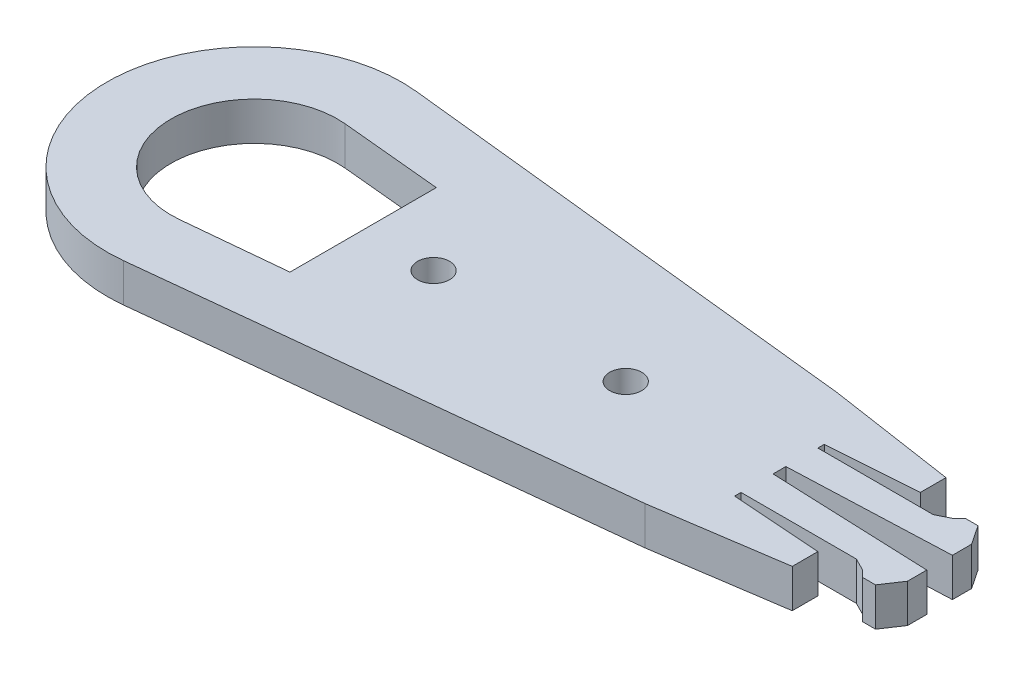
ISO-10303-21;
HEADER;
FILE_DESCRIPTION(('STEP AP214'),'2;1');
FILE_NAME('part.step','',(''),(''),'','','');
FILE_SCHEMA(('AUTOMOTIVE_DESIGN { 1 0 10303 214 1 1 1 1 }'));
ENDSEC;
DATA;
#1=APPLICATION_CONTEXT('core data for automotive mechanical design processes');
#2=APPLICATION_PROTOCOL_DEFINITION('international standard','automotive_design',2000,#1);
#3=PRODUCT_CONTEXT('',#1,'mechanical');
#4=PRODUCT('Part','Part','',(#3));
#5=PRODUCT_RELATED_PRODUCT_CATEGORY('part','',(#4));
#6=PRODUCT_DEFINITION_FORMATION('','',#4);
#7=PRODUCT_DEFINITION_CONTEXT('part definition',#1,'design');
#8=PRODUCT_DEFINITION('design','',#6,#7);
#9=PRODUCT_DEFINITION_SHAPE('','',#8);
#10=(LENGTH_UNIT() NAMED_UNIT(*) SI_UNIT(.MILLI.,.METRE.));
#11=(NAMED_UNIT(*) PLANE_ANGLE_UNIT() SI_UNIT($,.RADIAN.));
#12=(NAMED_UNIT(*) SI_UNIT($,.STERADIAN.) SOLID_ANGLE_UNIT());
#13=UNCERTAINTY_MEASURE_WITH_UNIT(LENGTH_MEASURE(1.E-05),#10,'distance_accuracy_value','');
#14=(GEOMETRIC_REPRESENTATION_CONTEXT(3) GLOBAL_UNCERTAINTY_ASSIGNED_CONTEXT((#13)) GLOBAL_UNIT_ASSIGNED_CONTEXT((#10,
#11,#12)) REPRESENTATION_CONTEXT('',''));
#15=CARTESIAN_POINT('',(0.,0.,0.));
#16=DIRECTION('',(0.,0.,1.));
#17=DIRECTION('',(1.,0.,0.));
#18=AXIS2_PLACEMENT_3D('',#15,#16,#17);
#19=CARTESIAN_POINT('',(1.93643031784841,-3.,12.9095354523227));
#20=DIRECTION('',(-0.148340452930245,0.,-0.988936352868297));
#21=DIRECTION('',(-0.988936352868298,0.,0.148340452930245));
#22=AXIS2_PLACEMENT_3D('',#19,#20,#21);
#23=PLANE('',#22);
#24=DIRECTION('',(-0.988936352868298,0.,0.148340452930245));
#25=VECTOR('',#24,1.);
#26=CARTESIAN_POINT('',(1.93643031784841,0.,12.9095354523227));
#27=LINE('',#26,#25);
#28=CARTESIAN_POINT('',(48.,0.,6.));
#29=VERTEX_POINT('',#28);
#30=CARTESIAN_POINT('',(38.,0.,7.5));
#31=VERTEX_POINT('',#30);
#32=EDGE_CURVE('E280',#29,#31,#27,.T.);
#33=ORIENTED_EDGE('',*,*,#32,.T.);
#34=DIRECTION('',(0.,1.,0.));
#35=VECTOR('',#34,1.);
#36=CARTESIAN_POINT('',(38.,-3.,7.5));
#37=LINE('',#36,#35);
#38=CARTESIAN_POINT('',(38.,-3.,7.5));
#39=VERTEX_POINT('',#38);
#40=EDGE_CURVE('E11',#39,#31,#37,.T.);
#41=ORIENTED_EDGE('',*,*,#40,.F.);
#42=DIRECTION('',(-0.988936352868298,0.,0.148340452930245));
#43=VECTOR('',#42,1.);
#44=CARTESIAN_POINT('',(1.93643031784841,-3.,12.9095354523227));
#45=LINE('',#44,#43);
#46=CARTESIAN_POINT('',(48.,-3.,6.));
#47=VERTEX_POINT('',#46);
#48=EDGE_CURVE('E423',#47,#39,#45,.T.);
#49=ORIENTED_EDGE('',*,*,#48,.F.);
#50=DIRECTION('',(0.,1.,0.));
#51=VECTOR('',#50,1.);
#52=CARTESIAN_POINT('',(48.,-3.,6.));
#53=LINE('',#52,#51);
#54=EDGE_CURVE('E397',#47,#29,#53,.T.);
#55=ORIENTED_EDGE('',*,*,#54,.T.);
#56=EDGE_LOOP('',(#33,#41,#49,#55));
#57=FACE_BOUND('',#56,.T.);
#58=ADVANCED_FACE('F34',(#57),#23,.F.);
#59=CARTESIAN_POINT('',(1.22340660120884,-3.,11.4347398872086));
#60=DIRECTION('',(-0.106383182713812,0.,-0.994325207583354));
#61=DIRECTION('',(-0.994325207583354,0.,0.106383182713812));
#62=AXIS2_PLACEMENT_3D('',#59,#60,#61);
#63=PLANE('',#62);
#64=DIRECTION('',(-0.994325207583354,0.,0.106383182713812));
#65=VECTOR('',#64,1.);
#66=CARTESIAN_POINT('',(1.22340660120884,0.,11.4347398872086));
#67=LINE('',#66,#65);
#68=CARTESIAN_POINT('',(1.22340660120884,0.,11.4347398872086));
#69=VERTEX_POINT('',#68);
#70=EDGE_CURVE('E152',#31,#69,#67,.T.);
#71=ORIENTED_EDGE('',*,*,#70,.T.);
#72=DIRECTION('',(0.,1.,0.));
#73=VECTOR('',#72,1.);
#74=CARTESIAN_POINT('',(1.22340660120884,-3.,11.4347398872086));
#75=LINE('',#74,#73);
#76=CARTESIAN_POINT('',(1.22340660120884,-3.,11.4347398872086));
#77=VERTEX_POINT('',#76);
#78=EDGE_CURVE('E44',#77,#69,#75,.T.);
#79=ORIENTED_EDGE('',*,*,#78,.F.);
#80=DIRECTION('',(-0.994325207583354,0.,0.106383182713812));
#81=VECTOR('',#80,1.);
#82=CARTESIAN_POINT('',(1.22340660120884,-3.,11.4347398872086));
#83=LINE('',#82,#81);
#84=EDGE_CURVE('E52',#39,#77,#83,.T.);
#85=ORIENTED_EDGE('',*,*,#84,.F.);
#86=ORIENTED_EDGE('',*,*,#40,.T.);
#87=EDGE_LOOP('',(#71,#79,#85,#86));
#88=FACE_BOUND('',#87,.T.);
#89=ADVANCED_FACE('F582',(#88),#63,.F.);
#90=CARTESIAN_POINT('',(0.,-3.,0.));
#91=DIRECTION('',(0.,1.,0.));
#92=DIRECTION('',(0.,0.,1.));
#93=AXIS2_PLACEMENT_3D('',#90,#91,#92);
#94=CYLINDRICAL_SURFACE('',#93,11.5);
#95=CARTESIAN_POINT('',(0.,0.,0.));
#96=DIRECTION('',(0.,1.,0.));
#97=DIRECTION('',(0.,0.,1.));
#98=AXIS2_PLACEMENT_3D('',#95,#96,#97);
#99=CIRCLE('',#98,11.5);
#100=CARTESIAN_POINT('',(1.22340660120884,0.,-11.4347398872086));
#101=VERTEX_POINT('',#100);
#102=EDGE_CURVE('E244',#101,#69,#99,.T.);
#103=ORIENTED_EDGE('',*,*,#102,.F.);
#104=DIRECTION('',(0.,1.,0.));
#105=VECTOR('',#104,1.);
#106=CARTESIAN_POINT('',(1.22340660120884,-3.,-11.4347398872086));
#107=LINE('',#106,#105);
#108=CARTESIAN_POINT('',(1.22340660120884,-3.,-11.4347398872086));
#109=VERTEX_POINT('',#108);
#110=EDGE_CURVE('E239',#109,#101,#107,.T.);
#111=ORIENTED_EDGE('',*,*,#110,.F.);
#112=CARTESIAN_POINT('',(0.,-3.,0.));
#113=DIRECTION('',(0.,1.,0.));
#114=DIRECTION('',(0.,0.,1.));
#115=AXIS2_PLACEMENT_3D('',#112,#113,#114);
#116=CIRCLE('',#115,11.5);
#117=EDGE_CURVE('E243',#109,#77,#116,.T.);
#118=ORIENTED_EDGE('',*,*,#117,.T.);
#119=ORIENTED_EDGE('',*,*,#78,.T.);
#120=EDGE_LOOP('',(#103,#111,#118,#119));
#121=FACE_BOUND('',#120,.T.);
#122=ADVANCED_FACE('F241',(#121),#94,.T.);
#123=CARTESIAN_POINT('',(1.22340660120883,-3.,-11.4347398872086));
#124=DIRECTION('',(-0.106383182713812,0.,0.994325207583354));
#125=DIRECTION('',(0.994325207583354,0.,0.106383182713812));
#126=AXIS2_PLACEMENT_3D('',#123,#124,#125);
#127=PLANE('',#126);
#128=DIRECTION('',(0.994325207583354,0.,0.106383182713812));
#129=VECTOR('',#128,1.);
#130=CARTESIAN_POINT('',(1.22340660120883,0.,-11.4347398872086));
#131=LINE('',#130,#129);
#132=CARTESIAN_POINT('',(38.,0.,-7.5));
#133=VERTEX_POINT('',#132);
#134=EDGE_CURVE('E338',#101,#133,#131,.T.);
#135=ORIENTED_EDGE('',*,*,#134,.T.);
#136=DIRECTION('',(0.,1.,0.));
#137=VECTOR('',#136,1.);
#138=CARTESIAN_POINT('',(38.,-3.,-7.5));
#139=LINE('',#138,#137);
#140=CARTESIAN_POINT('',(38.,-3.,-7.5));
#141=VERTEX_POINT('',#140);
#142=EDGE_CURVE('E248',#141,#133,#139,.T.);
#143=ORIENTED_EDGE('',*,*,#142,.F.);
#144=DIRECTION('',(0.994325207583354,0.,0.106383182713812));
#145=VECTOR('',#144,1.);
#146=CARTESIAN_POINT('',(1.22340660120883,-3.,-11.4347398872086));
#147=LINE('',#146,#145);
#148=EDGE_CURVE('E251',#109,#141,#147,.T.);
#149=ORIENTED_EDGE('',*,*,#148,.F.);
#150=ORIENTED_EDGE('',*,*,#110,.T.);
#151=EDGE_LOOP('',(#135,#143,#149,#150));
#152=FACE_BOUND('',#151,.T.);
#153=ADVANCED_FACE('F252',(#152),#127,.F.);
#154=CARTESIAN_POINT('',(1.93643031784841,-3.,-12.9095354523227));
#155=DIRECTION('',(0.148340452930245,0.,-0.988936352868297));
#156=DIRECTION('',(-0.988936352868298,0.,-0.148340452930245));
#157=AXIS2_PLACEMENT_3D('',#154,#155,#156);
#158=PLANE('',#157);
#159=DIRECTION('',(-0.988936352868298,0.,-0.148340452930245));
#160=VECTOR('',#159,1.);
#161=CARTESIAN_POINT('',(1.93643031784841,0.,-12.9095354523227));
#162=LINE('',#161,#160);
#163=CARTESIAN_POINT('',(48.,0.,-6.));
#164=VERTEX_POINT('',#163);
#165=EDGE_CURVE('E335',#164,#133,#162,.T.);
#166=ORIENTED_EDGE('',*,*,#165,.F.);
#167=DIRECTION('',(0.,1.,0.));
#168=VECTOR('',#167,1.);
#169=CARTESIAN_POINT('',(48.,-3.,-6.));
#170=LINE('',#169,#168);
#171=CARTESIAN_POINT('',(48.,-3.,-6.));
#172=VERTEX_POINT('',#171);
#173=EDGE_CURVE('E345',#172,#164,#170,.T.);
#174=ORIENTED_EDGE('',*,*,#173,.F.);
#175=DIRECTION('',(-0.988936352868298,0.,-0.148340452930245));
#176=VECTOR('',#175,1.);
#177=CARTESIAN_POINT('',(1.93643031784841,-3.,-12.9095354523227));
#178=LINE('',#177,#176);
#179=EDGE_CURVE('E256',#172,#141,#178,.T.);
#180=ORIENTED_EDGE('',*,*,#179,.T.);
#181=ORIENTED_EDGE('',*,*,#142,.T.);
#182=EDGE_LOOP('',(#166,#174,#180,#181));
#183=FACE_BOUND('',#182,.T.);
#184=ADVANCED_FACE('F483',(#183),#158,.T.);
#185=CARTESIAN_POINT('',(48.,-3.,0.));
#186=DIRECTION('',(1.,0.,0.));
#187=DIRECTION('',(0.,0.,-1.));
#188=AXIS2_PLACEMENT_3D('',#185,#186,#187);
#189=PLANE('',#188);
#190=DIRECTION('',(0.,0.,-1.));
#191=VECTOR('',#190,1.);
#192=CARTESIAN_POINT('',(48.,0.,0.));
#193=LINE('',#192,#191);
#194=CARTESIAN_POINT('',(48.,0.,-4.));
#195=VERTEX_POINT('',#194);
#196=EDGE_CURVE('E332',#195,#164,#193,.T.);
#197=ORIENTED_EDGE('',*,*,#196,.F.);
#198=DIRECTION('',(0.,1.,0.));
#199=VECTOR('',#198,1.);
#200=CARTESIAN_POINT('',(48.,-3.,-4.));
#201=LINE('',#200,#199);
#202=CARTESIAN_POINT('',(48.,-3.,-4.));
#203=VERTEX_POINT('',#202);
#204=EDGE_CURVE('E347',#203,#195,#201,.T.);
#205=ORIENTED_EDGE('',*,*,#204,.F.);
#206=DIRECTION('',(0.,0.,-1.));
#207=VECTOR('',#206,1.);
#208=CARTESIAN_POINT('',(48.,-3.,0.));
#209=LINE('',#208,#207);
#210=EDGE_CURVE('E479',#203,#172,#209,.T.);
#211=ORIENTED_EDGE('',*,*,#210,.T.);
#212=ORIENTED_EDGE('',*,*,#173,.T.);
#213=EDGE_LOOP('',(#197,#205,#211,#212));
#214=FACE_BOUND('',#213,.T.);
#215=ADVANCED_FACE('F488',(#214),#189,.T.);
#216=CARTESIAN_POINT('',(-0.0406091370558374,-3.,-0.568527918781723));
#217=DIRECTION('',(0.0712470499879097,0.,0.997458699830735));
#218=DIRECTION('',(0.997458699830735,0.,-0.0712470499879097));
#219=AXIS2_PLACEMENT_3D('',#216,#217,#218);
#220=PLANE('',#219);
#221=DIRECTION('',(0.997458699830735,0.,-0.0712470499879097));
#222=VECTOR('',#221,1.);
#223=CARTESIAN_POINT('',(-0.0406091370558374,0.,-0.568527918781723));
#224=LINE('',#223,#222);
#225=CARTESIAN_POINT('',(41.,0.,-3.5));
#226=VERTEX_POINT('',#225);
#227=EDGE_CURVE('E329',#226,#195,#224,.T.);
#228=ORIENTED_EDGE('',*,*,#227,.F.);
#229=DIRECTION('',(0.,1.,0.));
#230=VECTOR('',#229,1.);
#231=CARTESIAN_POINT('',(41.,-3.,-3.5));
#232=LINE('',#231,#230);
#233=CARTESIAN_POINT('',(41.,-3.,-3.5));
#234=VERTEX_POINT('',#233);
#235=EDGE_CURVE('E349',#234,#226,#232,.T.);
#236=ORIENTED_EDGE('',*,*,#235,.F.);
#237=DIRECTION('',(0.997458699830735,0.,-0.0712470499879097));
#238=VECTOR('',#237,1.);
#239=CARTESIAN_POINT('',(-0.0406091370558374,-3.,-0.568527918781723));
#240=LINE('',#239,#238);
#241=EDGE_CURVE('E476',#234,#203,#240,.T.);
#242=ORIENTED_EDGE('',*,*,#241,.T.);
#243=ORIENTED_EDGE('',*,*,#204,.T.);
#244=EDGE_LOOP('',(#228,#236,#242,#243));
#245=FACE_BOUND('',#244,.T.);
#246=ADVANCED_FACE('F491',(#245),#220,.T.);
#247=CARTESIAN_POINT('',(41.,-3.,0.));
#248=DIRECTION('',(1.,0.,0.));
#249=DIRECTION('',(0.,0.,-1.));
#250=AXIS2_PLACEMENT_3D('',#247,#248,#249);
#251=PLANE('',#250);
#252=DIRECTION('',(0.,0.,-1.));
#253=VECTOR('',#252,1.);
#254=CARTESIAN_POINT('',(41.,0.,0.));
#255=LINE('',#254,#253);
#256=CARTESIAN_POINT('',(41.,0.,-3.));
#257=VERTEX_POINT('',#256);
#258=EDGE_CURVE('E326',#257,#226,#255,.T.);
#259=ORIENTED_EDGE('',*,*,#258,.F.);
#260=DIRECTION('',(0.,1.,0.));
#261=VECTOR('',#260,1.);
#262=CARTESIAN_POINT('',(41.,-3.,-3.));
#263=LINE('',#262,#261);
#264=CARTESIAN_POINT('',(41.,-3.,-3.));
#265=VERTEX_POINT('',#264);
#266=EDGE_CURVE('E351',#265,#257,#263,.T.);
#267=ORIENTED_EDGE('',*,*,#266,.F.);
#268=DIRECTION('',(0.,0.,-1.));
#269=VECTOR('',#268,1.);
#270=CARTESIAN_POINT('',(41.,-3.,0.));
#271=LINE('',#270,#269);
#272=EDGE_CURVE('E473',#265,#234,#271,.T.);
#273=ORIENTED_EDGE('',*,*,#272,.T.);
#274=ORIENTED_EDGE('',*,*,#235,.T.);
#275=EDGE_LOOP('',(#259,#267,#273,#274));
#276=FACE_BOUND('',#275,.T.);
#277=ADVANCED_FACE('F496',(#276),#251,.T.);
#278=CARTESIAN_POINT('',(0.,-3.,-2.99999999999999));
#279=DIRECTION('',(0.,0.,-1.));
#280=DIRECTION('',(-1.,0.,0.));
#281=AXIS2_PLACEMENT_3D('',#278,#279,#280);
#282=PLANE('',#281);
#283=DIRECTION('',(-1.,0.,0.));
#284=VECTOR('',#283,1.);
#285=CARTESIAN_POINT('',(0.,0.,-2.99999999999999));
#286=LINE('',#285,#284);
#287=CARTESIAN_POINT('',(50.,0.,-3.));
#288=VERTEX_POINT('',#287);
#289=EDGE_CURVE('E323',#288,#257,#286,.T.);
#290=ORIENTED_EDGE('',*,*,#289,.F.);
#291=DIRECTION('',(0.,1.,0.));
#292=VECTOR('',#291,1.);
#293=CARTESIAN_POINT('',(50.,-3.,-3.));
#294=LINE('',#293,#292);
#295=CARTESIAN_POINT('',(50.,-3.,-3.));
#296=VERTEX_POINT('',#295);
#297=EDGE_CURVE('E353',#296,#288,#294,.T.);
#298=ORIENTED_EDGE('',*,*,#297,.F.);
#299=DIRECTION('',(-1.,0.,0.));
#300=VECTOR('',#299,1.);
#301=CARTESIAN_POINT('',(0.,-3.,-2.99999999999999));
#302=LINE('',#301,#300);
#303=EDGE_CURVE('E470',#296,#265,#302,.T.);
#304=ORIENTED_EDGE('',*,*,#303,.T.);
#305=ORIENTED_EDGE('',*,*,#266,.T.);
#306=EDGE_LOOP('',(#290,#298,#304,#305));
#307=FACE_BOUND('',#306,.T.);
#308=ADVANCED_FACE('F499',(#307),#282,.T.);
#309=CARTESIAN_POINT('',(8.79999999999999,-3.,17.6));
#310=DIRECTION('',(-0.447213595499958,0.,-0.894427190999916));
#311=DIRECTION('',(-0.894427190999916,0.,0.447213595499958));
#312=AXIS2_PLACEMENT_3D('',#309,#310,#311);
#313=PLANE('',#312);
#314=DIRECTION('',(-0.894427190999916,0.,0.447213595499958));
#315=VECTOR('',#314,1.);
#316=CARTESIAN_POINT('',(8.79999999999999,0.,17.6));
#317=LINE('',#316,#315);
#318=CARTESIAN_POINT('',(51.,0.,-3.5));
#319=VERTEX_POINT('',#318);
#320=EDGE_CURVE('E320',#319,#288,#317,.T.);
#321=ORIENTED_EDGE('',*,*,#320,.F.);
#322=DIRECTION('',(0.,1.,0.));
#323=VECTOR('',#322,1.);
#324=CARTESIAN_POINT('',(51.,-3.,-3.5));
#325=LINE('',#324,#323);
#326=CARTESIAN_POINT('',(51.,-3.,-3.5));
#327=VERTEX_POINT('',#326);
#328=EDGE_CURVE('E355',#327,#319,#325,.T.);
#329=ORIENTED_EDGE('',*,*,#328,.F.);
#330=DIRECTION('',(-0.894427190999916,0.,0.447213595499958));
#331=VECTOR('',#330,1.);
#332=CARTESIAN_POINT('',(8.79999999999999,-3.,17.6));
#333=LINE('',#332,#331);
#334=EDGE_CURVE('E467',#327,#296,#333,.T.);
#335=ORIENTED_EDGE('',*,*,#334,.T.);
#336=ORIENTED_EDGE('',*,*,#297,.T.);
#337=EDGE_LOOP('',(#321,#329,#335,#336));
#338=FACE_BOUND('',#337,.T.);
#339=ADVANCED_FACE('F504',(#338),#313,.T.);
#340=CARTESIAN_POINT('',(23.75,-3.,23.75));
#341=DIRECTION('',(-0.707106781186547,0.,-0.707106781186548));
#342=DIRECTION('',(-0.707106781186548,0.,0.707106781186547));
#343=AXIS2_PLACEMENT_3D('',#340,#341,#342);
#344=PLANE('',#343);
#345=DIRECTION('',(-0.707106781186548,0.,0.707106781186547));
#346=VECTOR('',#345,1.);
#347=CARTESIAN_POINT('',(23.75,0.,23.75));
#348=LINE('',#347,#346);
#349=CARTESIAN_POINT('',(51.5,0.,-4.));
#350=VERTEX_POINT('',#349);
#351=EDGE_CURVE('E317',#350,#319,#348,.T.);
#352=ORIENTED_EDGE('',*,*,#351,.F.);
#353=DIRECTION('',(0.,1.,0.));
#354=VECTOR('',#353,1.);
#355=CARTESIAN_POINT('',(51.5,-3.,-4.));
#356=LINE('',#355,#354);
#357=CARTESIAN_POINT('',(51.5,-3.,-4.));
#358=VERTEX_POINT('',#357);
#359=EDGE_CURVE('E357',#358,#350,#356,.T.);
#360=ORIENTED_EDGE('',*,*,#359,.F.);
#361=DIRECTION('',(-0.707106781186548,0.,0.707106781186547));
#362=VECTOR('',#361,1.);
#363=CARTESIAN_POINT('',(23.75,-3.,23.75));
#364=LINE('',#363,#362);
#365=EDGE_CURVE('E464',#358,#327,#364,.T.);
#366=ORIENTED_EDGE('',*,*,#365,.T.);
#367=ORIENTED_EDGE('',*,*,#328,.T.);
#368=EDGE_LOOP('',(#352,#360,#366,#367));
#369=FACE_BOUND('',#368,.T.);
#370=ADVANCED_FACE('F507',(#369),#344,.T.);
#371=CARTESIAN_POINT('',(0.,-3.,-3.99999999999996));
#372=DIRECTION('',(0.,0.,-1.));
#373=DIRECTION('',(-1.,0.,0.));
#374=AXIS2_PLACEMENT_3D('',#371,#372,#373);
#375=PLANE('',#374);
#376=DIRECTION('',(-1.,0.,0.));
#377=VECTOR('',#376,1.);
#378=CARTESIAN_POINT('',(0.,0.,-3.99999999999996));
#379=LINE('',#378,#377);
#380=CARTESIAN_POINT('',(52.5,0.,-4.));
#381=VERTEX_POINT('',#380);
#382=EDGE_CURVE('E314',#381,#350,#379,.T.);
#383=ORIENTED_EDGE('',*,*,#382,.F.);
#384=DIRECTION('',(0.,1.,0.));
#385=VECTOR('',#384,1.);
#386=CARTESIAN_POINT('',(52.5,-3.,-4.));
#387=LINE('',#386,#385);
#388=CARTESIAN_POINT('',(52.5,-3.,-4.));
#389=VERTEX_POINT('',#388);
#390=EDGE_CURVE('E359',#389,#381,#387,.T.);
#391=ORIENTED_EDGE('',*,*,#390,.F.);
#392=DIRECTION('',(-1.,0.,0.));
#393=VECTOR('',#392,1.);
#394=CARTESIAN_POINT('',(0.,-3.,-3.99999999999996));
#395=LINE('',#394,#393);
#396=EDGE_CURVE('E461',#389,#358,#395,.T.);
#397=ORIENTED_EDGE('',*,*,#396,.T.);
#398=ORIENTED_EDGE('',*,*,#359,.T.);
#399=EDGE_LOOP('',(#383,#391,#397,#398));
#400=FACE_BOUND('',#399,.T.);
#401=ADVANCED_FACE('F512',(#400),#375,.T.);
#402=CARTESIAN_POINT('',(38.1923076923077,-3.,-25.4615384615385));
#403=DIRECTION('',(0.832050294337844,0.,-0.554700196225229));
#404=DIRECTION('',(-0.554700196225229,0.,-0.832050294337843));
#405=AXIS2_PLACEMENT_3D('',#402,#403,#404);
#406=PLANE('',#405);
#407=DIRECTION('',(-0.554700196225229,0.,-0.832050294337844));
#408=VECTOR('',#407,1.);
#409=CARTESIAN_POINT('',(38.1923076923077,0.,-25.4615384615385));
#410=LINE('',#409,#408);
#411=CARTESIAN_POINT('',(53.5,0.,-2.5));
#412=VERTEX_POINT('',#411);
#413=EDGE_CURVE('E311',#412,#381,#410,.T.);
#414=ORIENTED_EDGE('',*,*,#413,.F.);
#415=DIRECTION('',(0.,1.,0.));
#416=VECTOR('',#415,1.);
#417=CARTESIAN_POINT('',(53.5,-3.,-2.5));
#418=LINE('',#417,#416);
#419=CARTESIAN_POINT('',(53.5,-3.,-2.5));
#420=VERTEX_POINT('',#419);
#421=EDGE_CURVE('E361',#420,#412,#418,.T.);
#422=ORIENTED_EDGE('',*,*,#421,.F.);
#423=DIRECTION('',(-0.554700196225229,0.,-0.832050294337844));
#424=VECTOR('',#423,1.);
#425=CARTESIAN_POINT('',(38.1923076923077,-3.,-25.4615384615385));
#426=LINE('',#425,#424);
#427=EDGE_CURVE('E458',#420,#389,#426,.T.);
#428=ORIENTED_EDGE('',*,*,#427,.T.);
#429=ORIENTED_EDGE('',*,*,#390,.T.);
#430=EDGE_LOOP('',(#414,#422,#428,#429));
#431=FACE_BOUND('',#430,.T.);
#432=ADVANCED_FACE('F515',(#431),#406,.T.);
#433=CARTESIAN_POINT('',(53.5,-3.,0.));
#434=DIRECTION('',(1.,0.,0.));
#435=DIRECTION('',(0.,0.,-1.));
#436=AXIS2_PLACEMENT_3D('',#433,#434,#435);
#437=PLANE('',#436);
#438=DIRECTION('',(0.,0.,-1.));
#439=VECTOR('',#438,1.);
#440=CARTESIAN_POINT('',(53.5,0.,0.));
#441=LINE('',#440,#439);
#442=CARTESIAN_POINT('',(53.5,0.,-1.));
#443=VERTEX_POINT('',#442);
#444=EDGE_CURVE('E308',#443,#412,#441,.T.);
#445=ORIENTED_EDGE('',*,*,#444,.F.);
#446=DIRECTION('',(0.,1.,0.));
#447=VECTOR('',#446,1.);
#448=CARTESIAN_POINT('',(53.5,-3.,-1.));
#449=LINE('',#448,#447);
#450=CARTESIAN_POINT('',(53.5,-3.,-1.));
#451=VERTEX_POINT('',#450);
#452=EDGE_CURVE('E363',#451,#443,#449,.T.);
#453=ORIENTED_EDGE('',*,*,#452,.F.);
#454=DIRECTION('',(0.,0.,-1.));
#455=VECTOR('',#454,1.);
#456=CARTESIAN_POINT('',(53.5,-3.,0.));
#457=LINE('',#456,#455);
#458=EDGE_CURVE('E455',#451,#420,#457,.T.);
#459=ORIENTED_EDGE('',*,*,#458,.T.);
#460=ORIENTED_EDGE('',*,*,#421,.T.);
#461=EDGE_LOOP('',(#445,#453,#459,#460));
#462=FACE_BOUND('',#461,.T.);
#463=ADVANCED_FACE('F520',(#462),#437,.T.);
#464=CARTESIAN_POINT('',(0.0455271565495208,-3.,1.13817891373802));
#465=DIRECTION('',(0.0399680383488716,0.,0.999200958721789));
#466=DIRECTION('',(0.99920095872179,0.,-0.0399680383488716));
#467=AXIS2_PLACEMENT_3D('',#464,#465,#466);
#468=PLANE('',#467);
#469=DIRECTION('',(0.99920095872179,0.,-0.0399680383488716));
#470=VECTOR('',#469,1.);
#471=CARTESIAN_POINT('',(0.0455271565495208,0.,1.13817891373802));
#472=LINE('',#471,#470);
#473=CARTESIAN_POINT('',(41.,0.,-0.5));
#474=VERTEX_POINT('',#473);
#475=EDGE_CURVE('E305',#474,#443,#472,.T.);
#476=ORIENTED_EDGE('',*,*,#475,.F.);
#477=DIRECTION('',(0.,1.,0.));
#478=VECTOR('',#477,1.);
#479=CARTESIAN_POINT('',(41.,-3.,-0.5));
#480=LINE('',#479,#478);
#481=CARTESIAN_POINT('',(41.,-3.,-0.5));
#482=VERTEX_POINT('',#481);
#483=EDGE_CURVE('E365',#482,#474,#480,.T.);
#484=ORIENTED_EDGE('',*,*,#483,.F.);
#485=DIRECTION('',(0.99920095872179,0.,-0.0399680383488716));
#486=VECTOR('',#485,1.);
#487=CARTESIAN_POINT('',(0.0455271565495208,-3.,1.13817891373802));
#488=LINE('',#487,#486);
#489=EDGE_CURVE('E452',#482,#451,#488,.T.);
#490=ORIENTED_EDGE('',*,*,#489,.T.);
#491=ORIENTED_EDGE('',*,*,#452,.T.);
#492=EDGE_LOOP('',(#476,#484,#490,#491));
#493=FACE_BOUND('',#492,.T.);
#494=ADVANCED_FACE('F523',(#493),#468,.T.);
#495=CARTESIAN_POINT('',(41.,-3.,0.));
#496=DIRECTION('',(-1.,0.,0.));
#497=DIRECTION('',(0.,0.,1.));
#498=AXIS2_PLACEMENT_3D('',#495,#496,#497);
#499=PLANE('',#498);
#500=DIRECTION('',(0.,0.,1.));
#501=VECTOR('',#500,1.);
#502=CARTESIAN_POINT('',(41.,0.,0.));
#503=LINE('',#502,#501);
#504=CARTESIAN_POINT('',(41.,0.,0.5));
#505=VERTEX_POINT('',#504);
#506=EDGE_CURVE('E303',#474,#505,#503,.T.);
#507=ORIENTED_EDGE('',*,*,#506,.T.);
#508=DIRECTION('',(0.,1.,0.));
#509=VECTOR('',#508,1.);
#510=CARTESIAN_POINT('',(41.,-3.,0.5));
#511=LINE('',#510,#509);
#512=CARTESIAN_POINT('',(41.,-3.,0.5));
#513=VERTEX_POINT('',#512);
#514=EDGE_CURVE('E367',#513,#505,#511,.T.);
#515=ORIENTED_EDGE('',*,*,#514,.F.);
#516=DIRECTION('',(0.,0.,1.));
#517=VECTOR('',#516,1.);
#518=CARTESIAN_POINT('',(41.,-3.,0.));
#519=LINE('',#518,#517);
#520=EDGE_CURVE('E450',#482,#513,#519,.T.);
#521=ORIENTED_EDGE('',*,*,#520,.F.);
#522=ORIENTED_EDGE('',*,*,#483,.T.);
#523=EDGE_LOOP('',(#507,#515,#521,#522));
#524=FACE_BOUND('',#523,.T.);
#525=ADVANCED_FACE('F529',(#524),#499,.F.);
#526=CARTESIAN_POINT('',(0.0455271565495208,-3.,-1.13817891373802));
#527=DIRECTION('',(-0.0399680383488716,0.,0.999200958721789));
#528=DIRECTION('',(0.99920095872179,0.,0.0399680383488716));
#529=AXIS2_PLACEMENT_3D('',#526,#527,#528);
#530=PLANE('',#529);
#531=DIRECTION('',(0.99920095872179,0.,0.0399680383488716));
#532=VECTOR('',#531,1.);
#533=CARTESIAN_POINT('',(0.0455271565495208,0.,-1.13817891373802));
#534=LINE('',#533,#532);
#535=CARTESIAN_POINT('',(53.5,0.,1.));
#536=VERTEX_POINT('',#535);
#537=EDGE_CURVE('E301',#505,#536,#534,.T.);
#538=ORIENTED_EDGE('',*,*,#537,.T.);
#539=DIRECTION('',(0.,1.,0.));
#540=VECTOR('',#539,1.);
#541=CARTESIAN_POINT('',(53.5,-3.,1.));
#542=LINE('',#541,#540);
#543=CARTESIAN_POINT('',(53.5,-3.,1.));
#544=VERTEX_POINT('',#543);
#545=EDGE_CURVE('E370',#544,#536,#542,.T.);
#546=ORIENTED_EDGE('',*,*,#545,.F.);
#547=DIRECTION('',(0.99920095872179,0.,0.0399680383488716));
#548=VECTOR('',#547,1.);
#549=CARTESIAN_POINT('',(0.0455271565495208,-3.,-1.13817891373802));
#550=LINE('',#549,#548);
#551=EDGE_CURVE('E448',#513,#544,#550,.T.);
#552=ORIENTED_EDGE('',*,*,#551,.F.);
#553=ORIENTED_EDGE('',*,*,#514,.T.);
#554=EDGE_LOOP('',(#538,#546,#552,#553));
#555=FACE_BOUND('',#554,.T.);
#556=ADVANCED_FACE('F533',(#555),#530,.F.);
#557=CARTESIAN_POINT('',(53.5,-3.,0.));
#558=DIRECTION('',(-1.,0.,0.));
#559=DIRECTION('',(0.,0.,1.));
#560=AXIS2_PLACEMENT_3D('',#557,#558,#559);
#561=PLANE('',#560);
#562=DIRECTION('',(0.,0.,1.));
#563=VECTOR('',#562,1.);
#564=CARTESIAN_POINT('',(53.5,0.,0.));
#565=LINE('',#564,#563);
#566=CARTESIAN_POINT('',(53.5,0.,2.5));
#567=VERTEX_POINT('',#566);
#568=EDGE_CURVE('E299',#536,#567,#565,.T.);
#569=ORIENTED_EDGE('',*,*,#568,.T.);
#570=DIRECTION('',(0.,1.,0.));
#571=VECTOR('',#570,1.);
#572=CARTESIAN_POINT('',(53.5,-3.,2.5));
#573=LINE('',#572,#571);
#574=CARTESIAN_POINT('',(53.5,-3.,2.5));
#575=VERTEX_POINT('',#574);
#576=EDGE_CURVE('E373',#575,#567,#573,.T.);
#577=ORIENTED_EDGE('',*,*,#576,.F.);
#578=DIRECTION('',(0.,0.,1.));
#579=VECTOR('',#578,1.);
#580=CARTESIAN_POINT('',(53.5,-3.,0.));
#581=LINE('',#580,#579);
#582=EDGE_CURVE('E446',#544,#575,#581,.T.);
#583=ORIENTED_EDGE('',*,*,#582,.F.);
#584=ORIENTED_EDGE('',*,*,#545,.T.);
#585=EDGE_LOOP('',(#569,#577,#583,#584));
#586=FACE_BOUND('',#585,.T.);
#587=ADVANCED_FACE('F538',(#586),#561,.F.);
#588=CARTESIAN_POINT('',(38.1923076923077,-3.,25.4615384615385));
#589=DIRECTION('',(-0.832050294337844,0.,-0.554700196225229));
#590=DIRECTION('',(-0.554700196225229,0.,0.832050294337843));
#591=AXIS2_PLACEMENT_3D('',#588,#589,#590);
#592=PLANE('',#591);
#593=DIRECTION('',(-0.554700196225229,0.,0.832050294337844));
#594=VECTOR('',#593,1.);
#595=CARTESIAN_POINT('',(38.1923076923077,0.,25.4615384615385));
#596=LINE('',#595,#594);
#597=CARTESIAN_POINT('',(52.5,0.,4.));
#598=VERTEX_POINT('',#597);
#599=EDGE_CURVE('E297',#567,#598,#596,.T.);
#600=ORIENTED_EDGE('',*,*,#599,.T.);
#601=DIRECTION('',(0.,1.,0.));
#602=VECTOR('',#601,1.);
#603=CARTESIAN_POINT('',(52.5,-3.,4.));
#604=LINE('',#603,#602);
#605=CARTESIAN_POINT('',(52.5,-3.,4.));
#606=VERTEX_POINT('',#605);
#607=EDGE_CURVE('E376',#606,#598,#604,.T.);
#608=ORIENTED_EDGE('',*,*,#607,.F.);
#609=DIRECTION('',(-0.554700196225229,0.,0.832050294337844));
#610=VECTOR('',#609,1.);
#611=CARTESIAN_POINT('',(38.1923076923077,-3.,25.4615384615385));
#612=LINE('',#611,#610);
#613=EDGE_CURVE('E444',#575,#606,#612,.T.);
#614=ORIENTED_EDGE('',*,*,#613,.F.);
#615=ORIENTED_EDGE('',*,*,#576,.T.);
#616=EDGE_LOOP('',(#600,#608,#614,#615));
#617=FACE_BOUND('',#616,.T.);
#618=ADVANCED_FACE('F544',(#617),#592,.F.);
#619=CARTESIAN_POINT('',(0.,-3.,3.99999999999996));
#620=DIRECTION('',(0.,0.,-1.));
#621=DIRECTION('',(-1.,0.,0.));
#622=AXIS2_PLACEMENT_3D('',#619,#620,#621);
#623=PLANE('',#622);
#624=DIRECTION('',(-1.,0.,0.));
#625=VECTOR('',#624,1.);
#626=CARTESIAN_POINT('',(0.,0.,3.99999999999996));
#627=LINE('',#626,#625);
#628=CARTESIAN_POINT('',(51.5,0.,4.));
#629=VERTEX_POINT('',#628);
#630=EDGE_CURVE('E295',#598,#629,#627,.T.);
#631=ORIENTED_EDGE('',*,*,#630,.T.);
#632=DIRECTION('',(0.,1.,0.));
#633=VECTOR('',#632,1.);
#634=CARTESIAN_POINT('',(51.5,-3.,4.));
#635=LINE('',#634,#633);
#636=CARTESIAN_POINT('',(51.5,-3.,4.));
#637=VERTEX_POINT('',#636);
#638=EDGE_CURVE('E379',#637,#629,#635,.T.);
#639=ORIENTED_EDGE('',*,*,#638,.F.);
#640=DIRECTION('',(-1.,0.,0.));
#641=VECTOR('',#640,1.);
#642=CARTESIAN_POINT('',(0.,-3.,3.99999999999996));
#643=LINE('',#642,#641);
#644=EDGE_CURVE('E442',#606,#637,#643,.T.);
#645=ORIENTED_EDGE('',*,*,#644,.F.);
#646=ORIENTED_EDGE('',*,*,#607,.T.);
#647=EDGE_LOOP('',(#631,#639,#645,#646));
#648=FACE_BOUND('',#647,.T.);
#649=ADVANCED_FACE('F548',(#648),#623,.F.);
#650=CARTESIAN_POINT('',(23.75,-3.,-23.75));
#651=DIRECTION('',(0.707106781186547,0.,-0.707106781186548));
#652=DIRECTION('',(-0.707106781186548,0.,-0.707106781186547));
#653=AXIS2_PLACEMENT_3D('',#650,#651,#652);
#654=PLANE('',#653);
#655=DIRECTION('',(-0.707106781186548,0.,-0.707106781186547));
#656=VECTOR('',#655,1.);
#657=CARTESIAN_POINT('',(23.75,0.,-23.75));
#658=LINE('',#657,#656);
#659=CARTESIAN_POINT('',(51.,0.,3.5));
#660=VERTEX_POINT('',#659);
#661=EDGE_CURVE('E293',#629,#660,#658,.T.);
#662=ORIENTED_EDGE('',*,*,#661,.T.);
#663=DIRECTION('',(0.,1.,0.));
#664=VECTOR('',#663,1.);
#665=CARTESIAN_POINT('',(51.,-3.,3.5));
#666=LINE('',#665,#664);
#667=CARTESIAN_POINT('',(51.,-3.,3.5));
#668=VERTEX_POINT('',#667);
#669=EDGE_CURVE('E382',#668,#660,#666,.T.);
#670=ORIENTED_EDGE('',*,*,#669,.F.);
#671=DIRECTION('',(-0.707106781186548,0.,-0.707106781186547));
#672=VECTOR('',#671,1.);
#673=CARTESIAN_POINT('',(23.75,-3.,-23.75));
#674=LINE('',#673,#672);
#675=EDGE_CURVE('E440',#637,#668,#674,.T.);
#676=ORIENTED_EDGE('',*,*,#675,.F.);
#677=ORIENTED_EDGE('',*,*,#638,.T.);
#678=EDGE_LOOP('',(#662,#670,#676,#677));
#679=FACE_BOUND('',#678,.T.);
#680=ADVANCED_FACE('F553',(#679),#654,.F.);
#681=CARTESIAN_POINT('',(8.79999999999999,-3.,-17.6));
#682=DIRECTION('',(0.447213595499958,0.,-0.894427190999916));
#683=DIRECTION('',(-0.894427190999916,0.,-0.447213595499958));
#684=AXIS2_PLACEMENT_3D('',#681,#682,#683);
#685=PLANE('',#684);
#686=DIRECTION('',(-0.894427190999916,0.,-0.447213595499958));
#687=VECTOR('',#686,1.);
#688=CARTESIAN_POINT('',(8.79999999999999,0.,-17.6));
#689=LINE('',#688,#687);
#690=CARTESIAN_POINT('',(50.,0.,3.));
#691=VERTEX_POINT('',#690);
#692=EDGE_CURVE('E291',#660,#691,#689,.T.);
#693=ORIENTED_EDGE('',*,*,#692,.T.);
#694=DIRECTION('',(0.,1.,0.));
#695=VECTOR('',#694,1.);
#696=CARTESIAN_POINT('',(50.,-3.,3.));
#697=LINE('',#696,#695);
#698=CARTESIAN_POINT('',(50.,-3.,3.));
#699=VERTEX_POINT('',#698);
#700=EDGE_CURVE('E385',#699,#691,#697,.T.);
#701=ORIENTED_EDGE('',*,*,#700,.F.);
#702=DIRECTION('',(-0.894427190999916,0.,-0.447213595499958));
#703=VECTOR('',#702,1.);
#704=CARTESIAN_POINT('',(8.79999999999999,-3.,-17.6));
#705=LINE('',#704,#703);
#706=EDGE_CURVE('E438',#668,#699,#705,.T.);
#707=ORIENTED_EDGE('',*,*,#706,.F.);
#708=ORIENTED_EDGE('',*,*,#669,.T.);
#709=EDGE_LOOP('',(#693,#701,#707,#708));
#710=FACE_BOUND('',#709,.T.);
#711=ADVANCED_FACE('F559',(#710),#685,.F.);
#712=CARTESIAN_POINT('',(0.,-3.,2.99999999999999));
#713=DIRECTION('',(0.,0.,-1.));
#714=DIRECTION('',(-1.,0.,0.));
#715=AXIS2_PLACEMENT_3D('',#712,#713,#714);
#716=PLANE('',#715);
#717=DIRECTION('',(-1.,0.,0.));
#718=VECTOR('',#717,1.);
#719=CARTESIAN_POINT('',(0.,0.,2.99999999999999));
#720=LINE('',#719,#718);
#721=CARTESIAN_POINT('',(41.,0.,3.));
#722=VERTEX_POINT('',#721);
#723=EDGE_CURVE('E289',#691,#722,#720,.T.);
#724=ORIENTED_EDGE('',*,*,#723,.T.);
#725=DIRECTION('',(0.,1.,0.));
#726=VECTOR('',#725,1.);
#727=CARTESIAN_POINT('',(41.,-3.,3.));
#728=LINE('',#727,#726);
#729=CARTESIAN_POINT('',(41.,-3.,3.));
#730=VERTEX_POINT('',#729);
#731=EDGE_CURVE('E388',#730,#722,#728,.T.);
#732=ORIENTED_EDGE('',*,*,#731,.F.);
#733=DIRECTION('',(-1.,0.,0.));
#734=VECTOR('',#733,1.);
#735=CARTESIAN_POINT('',(0.,-3.,2.99999999999999));
#736=LINE('',#735,#734);
#737=EDGE_CURVE('E436',#699,#730,#736,.T.);
#738=ORIENTED_EDGE('',*,*,#737,.F.);
#739=ORIENTED_EDGE('',*,*,#700,.T.);
#740=EDGE_LOOP('',(#724,#732,#738,#739));
#741=FACE_BOUND('',#740,.T.);
#742=ADVANCED_FACE('F563',(#741),#716,.F.);
#743=CARTESIAN_POINT('',(41.,-3.,0.));
#744=DIRECTION('',(-1.,0.,0.));
#745=DIRECTION('',(0.,0.,1.));
#746=AXIS2_PLACEMENT_3D('',#743,#744,#745);
#747=PLANE('',#746);
#748=DIRECTION('',(0.,0.,1.));
#749=VECTOR('',#748,1.);
#750=CARTESIAN_POINT('',(41.,0.,0.));
#751=LINE('',#750,#749);
#752=CARTESIAN_POINT('',(41.,0.,3.5));
#753=VERTEX_POINT('',#752);
#754=EDGE_CURVE('E287',#722,#753,#751,.T.);
#755=ORIENTED_EDGE('',*,*,#754,.T.);
#756=DIRECTION('',(0.,1.,0.));
#757=VECTOR('',#756,1.);
#758=CARTESIAN_POINT('',(41.,-3.,3.5));
#759=LINE('',#758,#757);
#760=CARTESIAN_POINT('',(41.,-3.,3.5));
#761=VERTEX_POINT('',#760);
#762=EDGE_CURVE('E391',#761,#753,#759,.T.);
#763=ORIENTED_EDGE('',*,*,#762,.F.);
#764=DIRECTION('',(0.,0.,1.));
#765=VECTOR('',#764,1.);
#766=CARTESIAN_POINT('',(41.,-3.,0.));
#767=LINE('',#766,#765);
#768=EDGE_CURVE('E434',#730,#761,#767,.T.);
#769=ORIENTED_EDGE('',*,*,#768,.F.);
#770=ORIENTED_EDGE('',*,*,#731,.T.);
#771=EDGE_LOOP('',(#755,#763,#769,#770));
#772=FACE_BOUND('',#771,.T.);
#773=ADVANCED_FACE('F568',(#772),#747,.F.);
#774=CARTESIAN_POINT('',(-0.0406091370558374,-3.,0.568527918781723));
#775=DIRECTION('',(-0.0712470499879097,0.,0.997458699830735));
#776=DIRECTION('',(0.997458699830735,0.,0.0712470499879097));
#777=AXIS2_PLACEMENT_3D('',#774,#775,#776);
#778=PLANE('',#777);
#779=DIRECTION('',(0.997458699830735,0.,0.0712470499879097));
#780=VECTOR('',#779,1.);
#781=CARTESIAN_POINT('',(-0.0406091370558374,0.,0.568527918781723));
#782=LINE('',#781,#780);
#783=CARTESIAN_POINT('',(48.,0.,4.));
#784=VERTEX_POINT('',#783);
#785=EDGE_CURVE('E285',#753,#784,#782,.T.);
#786=ORIENTED_EDGE('',*,*,#785,.T.);
#787=DIRECTION('',(0.,1.,0.));
#788=VECTOR('',#787,1.);
#789=CARTESIAN_POINT('',(48.,-3.,4.));
#790=LINE('',#789,#788);
#791=CARTESIAN_POINT('',(48.,-3.,4.));
#792=VERTEX_POINT('',#791);
#793=EDGE_CURVE('E394',#792,#784,#790,.T.);
#794=ORIENTED_EDGE('',*,*,#793,.F.);
#795=DIRECTION('',(0.997458699830735,0.,0.0712470499879097));
#796=VECTOR('',#795,1.);
#797=CARTESIAN_POINT('',(-0.0406091370558374,-3.,0.568527918781723));
#798=LINE('',#797,#796);
#799=EDGE_CURVE('E432',#761,#792,#798,.T.);
#800=ORIENTED_EDGE('',*,*,#799,.F.);
#801=ORIENTED_EDGE('',*,*,#762,.T.);
#802=EDGE_LOOP('',(#786,#794,#800,#801));
#803=FACE_BOUND('',#802,.T.);
#804=ADVANCED_FACE('F574',(#803),#778,.F.);
#805=CARTESIAN_POINT('',(0.,-3.,0.));
#806=DIRECTION('',(0.,1.,0.));
#807=DIRECTION('',(0.,0.,1.));
#808=AXIS2_PLACEMENT_3D('',#805,#806,#807);
#809=CYLINDRICAL_SURFACE('',#808,6.5);
#810=CARTESIAN_POINT('',(0.,0.,0.));
#811=DIRECTION('',(0.,1.,0.));
#812=DIRECTION('',(0.,0.,1.));
#813=AXIS2_PLACEMENT_3D('',#810,#811,#812);
#814=CIRCLE('',#813,6.5);
#815=CARTESIAN_POINT('',(0.622997391381457,0.,-6.47007528938666));
#816=VERTEX_POINT('',#815);
#817=CARTESIAN_POINT('',(0.622997391381457,0.,6.47007528938666));
#818=VERTEX_POINT('',#817);
#819=EDGE_CURVE('E269',#816,#818,#814,.T.);
#820=ORIENTED_EDGE('',*,*,#819,.T.);
#821=DIRECTION('',(0.,1.,0.));
#822=VECTOR('',#821,1.);
#823=CARTESIAN_POINT('',(0.622997391381457,-3.,6.47007528938666));
#824=LINE('',#823,#822);
#825=CARTESIAN_POINT('',(0.622997391381457,-3.,6.47007528938666));
#826=VERTEX_POINT('',#825);
#827=EDGE_CURVE('E400',#826,#818,#824,.T.);
#828=ORIENTED_EDGE('',*,*,#827,.F.);
#829=CARTESIAN_POINT('',(0.,-3.,0.));
#830=DIRECTION('',(0.,1.,0.));
#831=DIRECTION('',(0.,0.,1.));
#832=AXIS2_PLACEMENT_3D('',#829,#830,#831);
#833=CIRCLE('',#832,6.5);
#834=CARTESIAN_POINT('',(0.622997391381457,-3.,-6.47007528938666));
#835=VERTEX_POINT('',#834);
#836=EDGE_CURVE('E412',#835,#826,#833,.T.);
#837=ORIENTED_EDGE('',*,*,#836,.F.);
#838=DIRECTION('',(0.,1.,0.));
#839=VECTOR('',#838,1.);
#840=CARTESIAN_POINT('',(0.622997391381457,-3.,-6.47007528938666));
#841=LINE('',#840,#839);
#842=EDGE_CURVE('E38',#835,#816,#841,.T.);
#843=ORIENTED_EDGE('',*,*,#842,.T.);
#844=EDGE_LOOP('',(#820,#828,#837,#843));
#845=FACE_BOUND('',#844,.T.);
#846=ADVANCED_FACE('F410',(#845),#809,.F.);
#847=CARTESIAN_POINT('',(0.62299739138146,-3.,6.47007528938666));
#848=DIRECTION('',(-0.0958457525202246,0.,-0.995396198367179));
#849=DIRECTION('',(-0.995396198367179,0.,0.0958457525202246));
#850=AXIS2_PLACEMENT_3D('',#847,#848,#849);
#851=PLANE('',#850);
#852=DIRECTION('',(-0.995396198367179,0.,0.0958457525202246));
#853=VECTOR('',#852,1.);
#854=CARTESIAN_POINT('',(0.62299739138146,0.,6.47007528938666));
#855=LINE('',#854,#853);
#856=CARTESIAN_POINT('',(8.5,0.,5.71160620555325));
#857=VERTEX_POINT('',#856);
#858=EDGE_CURVE('E277',#857,#818,#855,.T.);
#859=ORIENTED_EDGE('',*,*,#858,.F.);
#860=DIRECTION('',(0.,1.,0.));
#861=VECTOR('',#860,1.);
#862=CARTESIAN_POINT('',(8.5,-3.,5.71160620555325));
#863=LINE('',#862,#861);
#864=CARTESIAN_POINT('',(8.5,-3.,5.71160620555325));
#865=VERTEX_POINT('',#864);
#866=EDGE_CURVE('E402',#865,#857,#863,.T.);
#867=ORIENTED_EDGE('',*,*,#866,.F.);
#868=DIRECTION('',(-0.995396198367179,0.,0.0958457525202246));
#869=VECTOR('',#868,1.);
#870=CARTESIAN_POINT('',(0.62299739138146,-3.,6.47007528938666));
#871=LINE('',#870,#869);
#872=EDGE_CURVE('E422',#865,#826,#871,.T.);
#873=ORIENTED_EDGE('',*,*,#872,.T.);
#874=ORIENTED_EDGE('',*,*,#827,.T.);
#875=EDGE_LOOP('',(#859,#867,#873,#874));
#876=FACE_BOUND('',#875,.T.);
#877=ADVANCED_FACE('F418',(#876),#851,.T.);
#878=CARTESIAN_POINT('',(8.5,-3.,0.));
#879=DIRECTION('',(-1.,0.,0.));
#880=DIRECTION('',(0.,0.,1.));
#881=AXIS2_PLACEMENT_3D('',#878,#879,#880);
#882=PLANE('',#881);
#883=DIRECTION('',(0.,0.,1.));
#884=VECTOR('',#883,1.);
#885=CARTESIAN_POINT('',(8.5,0.,0.));
#886=LINE('',#885,#884);
#887=CARTESIAN_POINT('',(8.5,0.,-5.71160620555325));
#888=VERTEX_POINT('',#887);
#889=EDGE_CURVE('E274',#888,#857,#886,.T.);
#890=ORIENTED_EDGE('',*,*,#889,.F.);
#891=DIRECTION('',(0.,1.,0.));
#892=VECTOR('',#891,1.);
#893=CARTESIAN_POINT('',(8.5,-3.,-5.71160620555325));
#894=LINE('',#893,#892);
#895=CARTESIAN_POINT('',(8.5,-3.,-5.71160620555325));
#896=VERTEX_POINT('',#895);
#897=EDGE_CURVE('E403',#896,#888,#894,.T.);
#898=ORIENTED_EDGE('',*,*,#897,.F.);
#899=DIRECTION('',(0.,0.,1.));
#900=VECTOR('',#899,1.);
#901=CARTESIAN_POINT('',(8.5,-3.,0.));
#902=LINE('',#901,#900);
#903=EDGE_CURVE('E424',#896,#865,#902,.T.);
#904=ORIENTED_EDGE('',*,*,#903,.T.);
#905=ORIENTED_EDGE('',*,*,#866,.T.);
#906=EDGE_LOOP('',(#890,#898,#904,#905));
#907=FACE_BOUND('',#906,.T.);
#908=ADVANCED_FACE('F604',(#907),#882,.T.);
#909=CARTESIAN_POINT('',(0.62299739138146,-3.,-6.47007528938666));
#910=DIRECTION('',(0.0958457525202246,0.,-0.995396198367179));
#911=DIRECTION('',(-0.995396198367179,0.,-0.0958457525202246));
#912=AXIS2_PLACEMENT_3D('',#909,#910,#911);
#913=PLANE('',#912);
#914=DIRECTION('',(-0.995396198367179,0.,-0.0958457525202246));
#915=VECTOR('',#914,1.);
#916=CARTESIAN_POINT('',(0.62299739138146,0.,-6.47007528938666));
#917=LINE('',#916,#915);
#918=EDGE_CURVE('E272',#888,#816,#917,.T.);
#919=ORIENTED_EDGE('',*,*,#918,.T.);
#920=ORIENTED_EDGE('',*,*,#842,.F.);
#921=DIRECTION('',(-0.995396198367179,0.,-0.0958457525202246));
#922=VECTOR('',#921,1.);
#923=CARTESIAN_POINT('',(0.62299739138146,-3.,-6.47007528938666));
#924=LINE('',#923,#922);
#925=EDGE_CURVE('E160',#896,#835,#924,.T.);
#926=ORIENTED_EDGE('',*,*,#925,.F.);
#927=ORIENTED_EDGE('',*,*,#897,.T.);
#928=EDGE_LOOP('',(#919,#920,#926,#927));
#929=FACE_BOUND('',#928,.T.);
#930=ADVANCED_FACE('F607',(#929),#913,.F.);
#931=CARTESIAN_POINT('',(14.,-3.,0.));
#932=DIRECTION('',(0.,1.,0.));
#933=DIRECTION('',(0.,0.,1.));
#934=AXIS2_PLACEMENT_3D('',#931,#932,#933);
#935=CYLINDRICAL_SURFACE('',#934,1.25);
#936=CARTESIAN_POINT('',(14.,-3.,0.));
#937=DIRECTION('',(0.,1.,0.));
#938=DIRECTION('',(0.,0.,1.));
#939=AXIS2_PLACEMENT_3D('',#936,#937,#938);
#940=CIRCLE('',#939,1.25);
#941=CARTESIAN_POINT('',(14.,-3.,1.25));
#942=VERTEX_POINT('',#941);
#943=EDGE_CURVE('E622',#942,#942,#940,.T.);
#944=ORIENTED_EDGE('',*,*,#943,.F.);
#945=EDGE_LOOP('',(#944));
#946=FACE_BOUND('',#945,.T.);
#947=CARTESIAN_POINT('',(14.,0.,0.));
#948=DIRECTION('',(0.,1.,0.));
#949=DIRECTION('',(0.,0.,1.));
#950=AXIS2_PLACEMENT_3D('',#947,#948,#949);
#951=CIRCLE('',#950,1.25);
#952=CARTESIAN_POINT('',(14.,0.,1.25));
#953=VERTEX_POINT('',#952);
#954=EDGE_CURVE('E266',#953,#953,#951,.T.);
#955=ORIENTED_EDGE('',*,*,#954,.T.);
#956=EDGE_LOOP('',(#955));
#957=FACE_BOUND('',#956,.T.);
#958=ADVANCED_FACE('F611',(#946,#957),#935,.F.);
#959=CARTESIAN_POINT('',(29.,-3.,0.));
#960=DIRECTION('',(0.,1.,0.));
#961=DIRECTION('',(0.,0.,1.));
#962=AXIS2_PLACEMENT_3D('',#959,#960,#961);
#963=CYLINDRICAL_SURFACE('',#962,1.25);
#964=CARTESIAN_POINT('',(29.,-3.,0.));
#965=DIRECTION('',(0.,1.,0.));
#966=DIRECTION('',(0.,0.,1.));
#967=AXIS2_PLACEMENT_3D('',#964,#965,#966);
#968=CIRCLE('',#967,1.25);
#969=CARTESIAN_POINT('',(29.,-3.,1.25));
#970=VERTEX_POINT('',#969);
#971=EDGE_CURVE('E341',#970,#970,#968,.T.);
#972=ORIENTED_EDGE('',*,*,#971,.F.);
#973=EDGE_LOOP('',(#972));
#974=FACE_BOUND('',#973,.T.);
#975=CARTESIAN_POINT('',(29.,0.,0.));
#976=DIRECTION('',(0.,1.,0.));
#977=DIRECTION('',(0.,0.,1.));
#978=AXIS2_PLACEMENT_3D('',#975,#976,#977);
#979=CIRCLE('',#978,1.25);
#980=CARTESIAN_POINT('',(29.,0.,1.25));
#981=VERTEX_POINT('',#980);
#982=EDGE_CURVE('E263',#981,#981,#979,.T.);
#983=ORIENTED_EDGE('',*,*,#982,.T.);
#984=EDGE_LOOP('',(#983));
#985=FACE_BOUND('',#984,.T.);
#986=ADVANCED_FACE('F36',(#974,#985),#963,.F.);
#987=CARTESIAN_POINT('',(48.,-3.,0.));
#988=DIRECTION('',(-1.,0.,0.));
#989=DIRECTION('',(0.,0.,1.));
#990=AXIS2_PLACEMENT_3D('',#987,#988,#989);
#991=PLANE('',#990);
#992=DIRECTION('',(0.,0.,1.));
#993=VECTOR('',#992,1.);
#994=CARTESIAN_POINT('',(48.,0.,0.));
#995=LINE('',#994,#993);
#996=EDGE_CURVE('E283',#784,#29,#995,.T.);
#997=ORIENTED_EDGE('',*,*,#996,.T.);
#998=ORIENTED_EDGE('',*,*,#54,.F.);
#999=DIRECTION('',(0.,0.,1.));
#1000=VECTOR('',#999,1.);
#1001=CARTESIAN_POINT('',(48.,-3.,0.));
#1002=LINE('',#1001,#1000);
#1003=EDGE_CURVE('E426',#792,#47,#1002,.T.);
#1004=ORIENTED_EDGE('',*,*,#1003,.F.);
#1005=ORIENTED_EDGE('',*,*,#793,.T.);
#1006=EDGE_LOOP('',(#997,#998,#1004,#1005));
#1007=FACE_BOUND('',#1006,.T.);
#1008=ADVANCED_FACE('F578',(#1007),#991,.F.);
#1009=CARTESIAN_POINT('',(0.,-3.,0.));
#1010=DIRECTION('',(0.,1.,0.));
#1011=DIRECTION('',(0.,0.,1.));
#1012=AXIS2_PLACEMENT_3D('',#1009,#1010,#1011);
#1013=PLANE('',#1012);
#1014=ORIENTED_EDGE('',*,*,#971,.T.);
#1015=EDGE_LOOP('',(#1014));
#1016=FACE_BOUND('',#1015,.T.);
#1017=ORIENTED_EDGE('',*,*,#943,.T.);
#1018=EDGE_LOOP('',(#1017));
#1019=FACE_BOUND('',#1018,.T.);
#1020=ORIENTED_EDGE('',*,*,#836,.T.);
#1021=ORIENTED_EDGE('',*,*,#872,.F.);
#1022=ORIENTED_EDGE('',*,*,#903,.F.);
#1023=ORIENTED_EDGE('',*,*,#925,.T.);
#1024=EDGE_LOOP('',(#1020,#1021,#1022,#1023));
#1025=FACE_BOUND('',#1024,.T.);
#1026=ORIENTED_EDGE('',*,*,#48,.T.);
#1027=ORIENTED_EDGE('',*,*,#84,.T.);
#1028=ORIENTED_EDGE('',*,*,#117,.F.);
#1029=ORIENTED_EDGE('',*,*,#148,.T.);
#1030=ORIENTED_EDGE('',*,*,#179,.F.);
#1031=ORIENTED_EDGE('',*,*,#210,.F.);
#1032=ORIENTED_EDGE('',*,*,#241,.F.);
#1033=ORIENTED_EDGE('',*,*,#272,.F.);
#1034=ORIENTED_EDGE('',*,*,#303,.F.);
#1035=ORIENTED_EDGE('',*,*,#334,.F.);
#1036=ORIENTED_EDGE('',*,*,#365,.F.);
#1037=ORIENTED_EDGE('',*,*,#396,.F.);
#1038=ORIENTED_EDGE('',*,*,#427,.F.);
#1039=ORIENTED_EDGE('',*,*,#458,.F.);
#1040=ORIENTED_EDGE('',*,*,#489,.F.);
#1041=ORIENTED_EDGE('',*,*,#520,.T.);
#1042=ORIENTED_EDGE('',*,*,#551,.T.);
#1043=ORIENTED_EDGE('',*,*,#582,.T.);
#1044=ORIENTED_EDGE('',*,*,#613,.T.);
#1045=ORIENTED_EDGE('',*,*,#644,.T.);
#1046=ORIENTED_EDGE('',*,*,#675,.T.);
#1047=ORIENTED_EDGE('',*,*,#706,.T.);
#1048=ORIENTED_EDGE('',*,*,#737,.T.);
#1049=ORIENTED_EDGE('',*,*,#768,.T.);
#1050=ORIENTED_EDGE('',*,*,#799,.T.);
#1051=ORIENTED_EDGE('',*,*,#1003,.T.);
#1052=EDGE_LOOP('',(#1026,#1027,#1028,#1029,#1030,#1031,#1032,#1033,#1034,#1035,#1036,#1037,
#1038,#1039,#1040,#1041,#1042,#1043,#1044,#1045,#1046,#1047,#1048,#1049,#1050,#1051));
#1053=FACE_BOUND('',#1052,.T.);
#1054=ADVANCED_FACE('F258',(#1016,#1019,#1025,#1053),#1013,.F.);
#1055=CARTESIAN_POINT('',(0.,0.,0.));
#1056=DIRECTION('',(0.,1.,0.));
#1057=DIRECTION('',(0.,0.,1.));
#1058=AXIS2_PLACEMENT_3D('',#1055,#1056,#1057);
#1059=PLANE('',#1058);
#1060=ORIENTED_EDGE('',*,*,#982,.F.);
#1061=EDGE_LOOP('',(#1060));
#1062=FACE_BOUND('',#1061,.T.);
#1063=ORIENTED_EDGE('',*,*,#954,.F.);
#1064=EDGE_LOOP('',(#1063));
#1065=FACE_BOUND('',#1064,.T.);
#1066=ORIENTED_EDGE('',*,*,#819,.F.);
#1067=ORIENTED_EDGE('',*,*,#918,.F.);
#1068=ORIENTED_EDGE('',*,*,#889,.T.);
#1069=ORIENTED_EDGE('',*,*,#858,.T.);
#1070=EDGE_LOOP('',(#1066,#1067,#1068,#1069));
#1071=FACE_BOUND('',#1070,.T.);
#1072=ORIENTED_EDGE('',*,*,#32,.F.);
#1073=ORIENTED_EDGE('',*,*,#996,.F.);
#1074=ORIENTED_EDGE('',*,*,#785,.F.);
#1075=ORIENTED_EDGE('',*,*,#754,.F.);
#1076=ORIENTED_EDGE('',*,*,#723,.F.);
#1077=ORIENTED_EDGE('',*,*,#692,.F.);
#1078=ORIENTED_EDGE('',*,*,#661,.F.);
#1079=ORIENTED_EDGE('',*,*,#630,.F.);
#1080=ORIENTED_EDGE('',*,*,#599,.F.);
#1081=ORIENTED_EDGE('',*,*,#568,.F.);
#1082=ORIENTED_EDGE('',*,*,#537,.F.);
#1083=ORIENTED_EDGE('',*,*,#506,.F.);
#1084=ORIENTED_EDGE('',*,*,#475,.T.);
#1085=ORIENTED_EDGE('',*,*,#444,.T.);
#1086=ORIENTED_EDGE('',*,*,#413,.T.);
#1087=ORIENTED_EDGE('',*,*,#382,.T.);
#1088=ORIENTED_EDGE('',*,*,#351,.T.);
#1089=ORIENTED_EDGE('',*,*,#320,.T.);
#1090=ORIENTED_EDGE('',*,*,#289,.T.);
#1091=ORIENTED_EDGE('',*,*,#258,.T.);
#1092=ORIENTED_EDGE('',*,*,#227,.T.);
#1093=ORIENTED_EDGE('',*,*,#196,.T.);
#1094=ORIENTED_EDGE('',*,*,#165,.T.);
#1095=ORIENTED_EDGE('',*,*,#134,.F.);
#1096=ORIENTED_EDGE('',*,*,#102,.T.);
#1097=ORIENTED_EDGE('',*,*,#70,.F.);
#1098=EDGE_LOOP('',(#1072,#1073,#1074,#1075,#1076,#1077,#1078,#1079,#1080,#1081,#1082,#1083,
#1084,#1085,#1086,#1087,#1088,#1089,#1090,#1091,#1092,#1093,#1094,#1095,#1096,#1097));
#1099=FACE_BOUND('',#1098,.T.);
#1100=ADVANCED_FACE('F414',(#1062,#1065,#1071,#1099),#1059,.T.);
#1101=CLOSED_SHELL('',(#58,#89,#122,#153,#184,#215,#246,#277,#308,#339,#370,#401,#432,#463,#494,
#525,#556,#587,#618,#649,#680,#711,#742,#773,#804,#846,#877,#908,#930,#958,#986,#1008,#1054,#1100));
#1102=MANIFOLD_SOLID_BREP('B2',#1101);
#1103=ADVANCED_BREP_SHAPE_REPRESENTATION('',(#18,#1102),#14);
#1104=SHAPE_DEFINITION_REPRESENTATION(#9,#1103);
ENDSEC;
END-ISO-10303-21;
